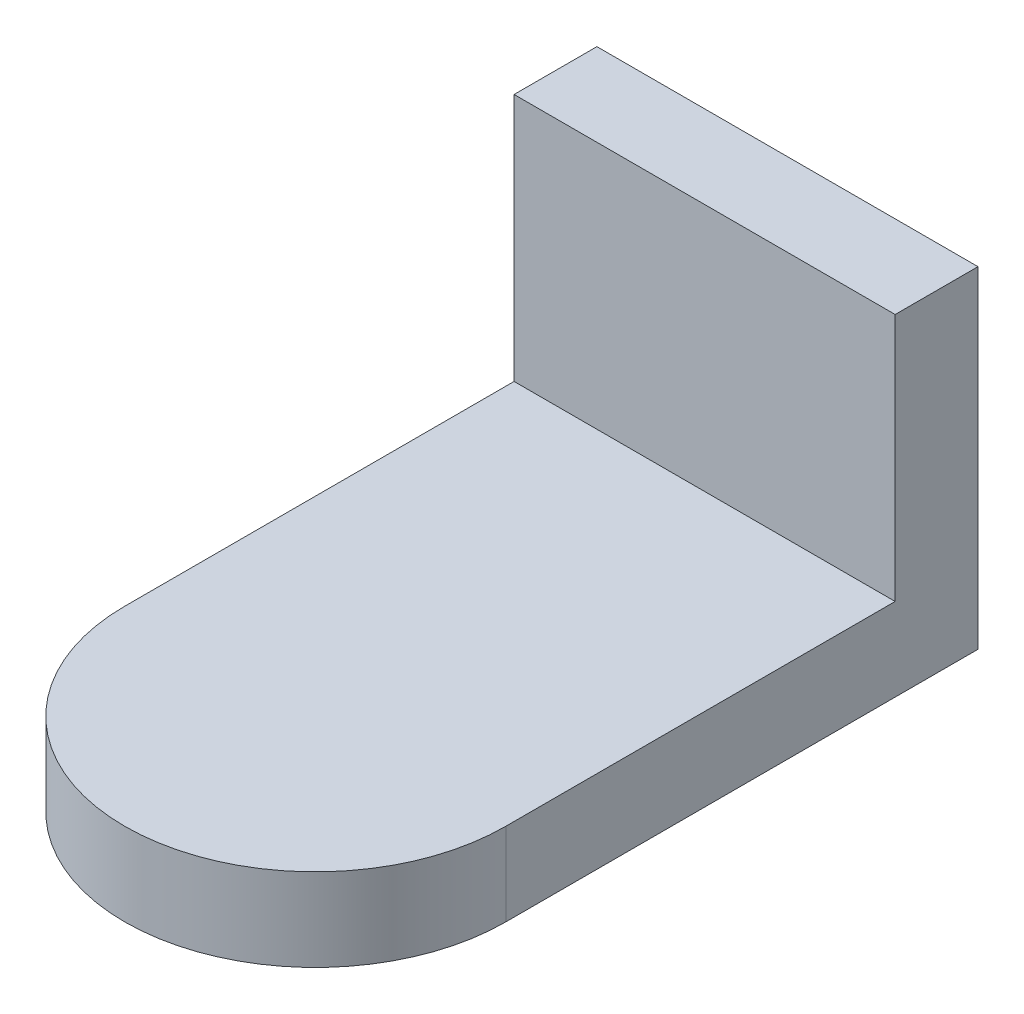
ISO-10303-21;
HEADER;
FILE_DESCRIPTION(('STEP AP214'),'2;1');
FILE_NAME('part.step','',(''),(''),'','','');
FILE_SCHEMA(('AUTOMOTIVE_DESIGN { 1 0 10303 214 1 1 1 1 }'));
ENDSEC;
DATA;
#1=APPLICATION_CONTEXT('core data for automotive mechanical design processes');
#2=APPLICATION_PROTOCOL_DEFINITION('international standard','automotive_design',2000,#1);
#3=PRODUCT_CONTEXT('',#1,'mechanical');
#4=PRODUCT('Part','Part','',(#3));
#5=PRODUCT_RELATED_PRODUCT_CATEGORY('part','',(#4));
#6=PRODUCT_DEFINITION_FORMATION('','',#4);
#7=PRODUCT_DEFINITION_CONTEXT('part definition',#1,'design');
#8=PRODUCT_DEFINITION('design','',#6,#7);
#9=PRODUCT_DEFINITION_SHAPE('','',#8);
#10=(LENGTH_UNIT() NAMED_UNIT(*) SI_UNIT(.MILLI.,.METRE.));
#11=(NAMED_UNIT(*) PLANE_ANGLE_UNIT() SI_UNIT($,.RADIAN.));
#12=(NAMED_UNIT(*) SI_UNIT($,.STERADIAN.) SOLID_ANGLE_UNIT());
#13=UNCERTAINTY_MEASURE_WITH_UNIT(LENGTH_MEASURE(1.E-05),#10,'distance_accuracy_value','');
#14=(GEOMETRIC_REPRESENTATION_CONTEXT(3) GLOBAL_UNCERTAINTY_ASSIGNED_CONTEXT((#13)) GLOBAL_UNIT_ASSIGNED_CONTEXT((#10,
#11,#12)) REPRESENTATION_CONTEXT('',''));
#15=CARTESIAN_POINT('',(0.,0.,0.));
#16=DIRECTION('',(0.,0.,1.));
#17=DIRECTION('',(1.,0.,0.));
#18=AXIS2_PLACEMENT_3D('',#15,#16,#17);
#19=CARTESIAN_POINT('',(0.,0.,-1.45));
#20=DIRECTION('',(0.,0.,1.));
#21=DIRECTION('',(-1.,0.,0.));
#22=AXIS2_PLACEMENT_3D('',#19,#20,#21);
#23=PLANE('',#22);
#24=DIRECTION('',(0.,1.,0.));
#25=VECTOR('',#24,1.);
#26=CARTESIAN_POINT('',(0.865,-0.2,-1.45));
#27=LINE('',#26,#25);
#28=CARTESIAN_POINT('',(0.865,-0.35,-1.45));
#29=VERTEX_POINT('',#28);
#30=CARTESIAN_POINT('',(0.865,-0.2,-1.45));
#31=VERTEX_POINT('',#30);
#32=EDGE_CURVE('E11',#29,#31,#27,.T.);
#33=ORIENTED_EDGE('',*,*,#32,.T.);
#34=DIRECTION('',(-1.,0.,0.));
#35=VECTOR('',#34,1.);
#36=CARTESIAN_POINT('',(0.635,-0.2,-1.45));
#37=LINE('',#36,#35);
#38=CARTESIAN_POINT('',(0.635,-0.2,-1.45));
#39=VERTEX_POINT('',#38);
#40=EDGE_CURVE('E24',#31,#39,#37,.T.);
#41=ORIENTED_EDGE('',*,*,#40,.T.);
#42=DIRECTION('',(0.,-1.,0.));
#43=VECTOR('',#42,1.);
#44=CARTESIAN_POINT('',(0.635,-0.2,-1.45));
#45=LINE('',#44,#43);
#46=CARTESIAN_POINT('',(0.635,-0.35,-1.45));
#47=VERTEX_POINT('',#46);
#48=EDGE_CURVE('E117',#39,#47,#45,.T.);
#49=ORIENTED_EDGE('',*,*,#48,.T.);
#50=DIRECTION('',(-1.,0.,0.));
#51=VECTOR('',#50,1.);
#52=CARTESIAN_POINT('',(0.635,-0.35,-1.45));
#53=LINE('',#52,#51);
#54=EDGE_CURVE('E85',#29,#47,#53,.T.);
#55=ORIENTED_EDGE('',*,*,#54,.F.);
#56=EDGE_LOOP('',(#33,#41,#49,#55));
#57=FACE_BOUND('',#56,.T.);
#58=ADVANCED_FACE('F17',(#57),#23,.T.);
#59=CARTESIAN_POINT('',(0.635,-0.2,-1.45));
#60=DIRECTION('',(0.,1.,0.));
#61=DIRECTION('',(-1.,0.,0.));
#62=AXIS2_PLACEMENT_3D('',#59,#60,#61);
#63=PLANE('',#62);
#64=DIRECTION('',(-1.,0.,0.));
#65=VECTOR('',#64,1.);
#66=CARTESIAN_POINT('',(0.635,-0.2,-1.5));
#67=LINE('',#66,#65);
#68=CARTESIAN_POINT('',(0.865,-0.2,-1.5));
#69=VERTEX_POINT('',#68);
#70=CARTESIAN_POINT('',(0.635,-0.2,-1.5));
#71=VERTEX_POINT('',#70);
#72=EDGE_CURVE('E114',#69,#71,#67,.T.);
#73=ORIENTED_EDGE('',*,*,#72,.T.);
#74=DIRECTION('',(0.,0.,-1.));
#75=VECTOR('',#74,1.);
#76=CARTESIAN_POINT('',(0.635,-0.2,-1.45));
#77=LINE('',#76,#75);
#78=EDGE_CURVE('E111',#39,#71,#77,.T.);
#79=ORIENTED_EDGE('',*,*,#78,.F.);
#80=ORIENTED_EDGE('',*,*,#40,.F.);
#81=DIRECTION('',(0.,0.,-1.));
#82=VECTOR('',#81,1.);
#83=CARTESIAN_POINT('',(0.865,-0.2,-1.45));
#84=LINE('',#83,#82);
#85=EDGE_CURVE('E108',#31,#69,#84,.T.);
#86=ORIENTED_EDGE('',*,*,#85,.T.);
#87=EDGE_LOOP('',(#73,#79,#80,#86));
#88=FACE_BOUND('',#87,.T.);
#89=ADVANCED_FACE('F121',(#88),#63,.T.);
#90=CARTESIAN_POINT('',(0.865,-0.2,-1.45));
#91=DIRECTION('',(1.,0.,0.));
#92=DIRECTION('',(0.,0.,1.));
#93=AXIS2_PLACEMENT_3D('',#90,#91,#92);
#94=PLANE('',#93);
#95=DIRECTION('',(0.,1.,0.));
#96=VECTOR('',#95,1.);
#97=CARTESIAN_POINT('',(0.865,-0.2,-1.5));
#98=LINE('',#97,#96);
#99=CARTESIAN_POINT('',(0.865,-0.4,-1.5));
#100=VERTEX_POINT('',#99);
#101=EDGE_CURVE('E105',#100,#69,#98,.T.);
#102=ORIENTED_EDGE('',*,*,#101,.T.);
#103=ORIENTED_EDGE('',*,*,#85,.F.);
#104=ORIENTED_EDGE('',*,*,#32,.F.);
#105=DIRECTION('',(0.,0.,-1.));
#106=VECTOR('',#105,1.);
#107=CARTESIAN_POINT('',(0.865,-0.35,-1.45));
#108=LINE('',#107,#106);
#109=CARTESIAN_POINT('',(0.865,-0.35,-1.215));
#110=VERTEX_POINT('',#109);
#111=EDGE_CURVE('E103',#110,#29,#108,.T.);
#112=ORIENTED_EDGE('',*,*,#111,.F.);
#113=DIRECTION('',(0.,-1.,0.));
#114=VECTOR('',#113,1.);
#115=CARTESIAN_POINT('',(0.865,-0.35,-1.215));
#116=LINE('',#115,#114);
#117=CARTESIAN_POINT('',(0.865,-0.4,-1.215));
#118=VERTEX_POINT('',#117);
#119=EDGE_CURVE('E89',#110,#118,#116,.T.);
#120=ORIENTED_EDGE('',*,*,#119,.T.);
#121=DIRECTION('',(0.,0.,-1.));
#122=VECTOR('',#121,1.);
#123=CARTESIAN_POINT('',(0.865,-0.4,-1.45));
#124=LINE('',#123,#122);
#125=EDGE_CURVE('E99',#118,#100,#124,.T.);
#126=ORIENTED_EDGE('',*,*,#125,.T.);
#127=EDGE_LOOP('',(#102,#103,#104,#112,#120,#126));
#128=FACE_BOUND('',#127,.T.);
#129=ADVANCED_FACE('F127',(#128),#94,.T.);
#130=CARTESIAN_POINT('',(0.635,-0.4,-1.45));
#131=DIRECTION('',(0.,-1.,0.));
#132=DIRECTION('',(1.,0.,0.));
#133=AXIS2_PLACEMENT_3D('',#130,#131,#132);
#134=PLANE('',#133);
#135=DIRECTION('',(1.,0.,0.));
#136=VECTOR('',#135,1.);
#137=CARTESIAN_POINT('',(0.635,-0.4,-1.5));
#138=LINE('',#137,#136);
#139=CARTESIAN_POINT('',(0.635,-0.4,-1.5));
#140=VERTEX_POINT('',#139);
#141=EDGE_CURVE('E96',#140,#100,#138,.T.);
#142=ORIENTED_EDGE('',*,*,#141,.T.);
#143=ORIENTED_EDGE('',*,*,#125,.F.);
#144=CARTESIAN_POINT('',(0.75,-0.4,-1.215));
#145=DIRECTION('',(0.,1.,0.));
#146=DIRECTION('',(1.,0.,0.));
#147=AXIS2_PLACEMENT_3D('',#144,#145,#146);
#148=CIRCLE('',#147,0.115);
#149=CARTESIAN_POINT('',(0.635,-0.4,-1.215));
#150=VERTEX_POINT('',#149);
#151=EDGE_CURVE('E94',#150,#118,#148,.T.);
#152=ORIENTED_EDGE('',*,*,#151,.F.);
#153=DIRECTION('',(0.,0.,-1.));
#154=VECTOR('',#153,1.);
#155=CARTESIAN_POINT('',(0.635,-0.4,-1.45));
#156=LINE('',#155,#154);
#157=EDGE_CURVE('E73',#150,#140,#156,.T.);
#158=ORIENTED_EDGE('',*,*,#157,.T.);
#159=EDGE_LOOP('',(#142,#143,#152,#158));
#160=FACE_BOUND('',#159,.T.);
#161=ADVANCED_FACE('F126',(#160),#134,.T.);
#162=CARTESIAN_POINT('',(0.635,-0.2,-1.45));
#163=DIRECTION('',(-1.,0.,0.));
#164=DIRECTION('',(0.,0.,-1.));
#165=AXIS2_PLACEMENT_3D('',#162,#163,#164);
#166=PLANE('',#165);
#167=DIRECTION('',(0.,-1.,0.));
#168=VECTOR('',#167,1.);
#169=CARTESIAN_POINT('',(0.635,-0.2,-1.5));
#170=LINE('',#169,#168);
#171=EDGE_CURVE('E77',#71,#140,#170,.T.);
#172=ORIENTED_EDGE('',*,*,#171,.T.);
#173=ORIENTED_EDGE('',*,*,#157,.F.);
#174=DIRECTION('',(0.,-1.,0.));
#175=VECTOR('',#174,1.);
#176=CARTESIAN_POINT('',(0.635,-0.35,-1.215));
#177=LINE('',#176,#175);
#178=CARTESIAN_POINT('',(0.635,-0.35,-1.215));
#179=VERTEX_POINT('',#178);
#180=EDGE_CURVE('E66',#179,#150,#177,.T.);
#181=ORIENTED_EDGE('',*,*,#180,.F.);
#182=DIRECTION('',(0.,0.,1.));
#183=VECTOR('',#182,1.);
#184=CARTESIAN_POINT('',(0.635,-0.35,-1.45));
#185=LINE('',#184,#183);
#186=EDGE_CURVE('E71',#47,#179,#185,.T.);
#187=ORIENTED_EDGE('',*,*,#186,.F.);
#188=ORIENTED_EDGE('',*,*,#48,.F.);
#189=ORIENTED_EDGE('',*,*,#78,.T.);
#190=EDGE_LOOP('',(#172,#173,#181,#187,#188,#189));
#191=FACE_BOUND('',#190,.T.);
#192=ADVANCED_FACE('F69',(#191),#166,.T.);
#193=CARTESIAN_POINT('',(0.,0.,-1.5));
#194=DIRECTION('',(0.,0.,1.));
#195=DIRECTION('',(-1.,0.,0.));
#196=AXIS2_PLACEMENT_3D('',#193,#194,#195);
#197=PLANE('',#196);
#198=ORIENTED_EDGE('',*,*,#72,.F.);
#199=ORIENTED_EDGE('',*,*,#101,.F.);
#200=ORIENTED_EDGE('',*,*,#141,.F.);
#201=ORIENTED_EDGE('',*,*,#171,.F.);
#202=EDGE_LOOP('',(#198,#199,#200,#201));
#203=FACE_BOUND('',#202,.T.);
#204=ADVANCED_FACE('F123',(#203),#197,.F.);
#205=CARTESIAN_POINT('',(0.75,-0.35,-1.215));
#206=DIRECTION('',(0.,-1.,0.));
#207=DIRECTION('',(1.,0.,0.));
#208=AXIS2_PLACEMENT_3D('',#205,#206,#207);
#209=CYLINDRICAL_SURFACE('',#208,0.115);
#210=ORIENTED_EDGE('',*,*,#151,.T.);
#211=ORIENTED_EDGE('',*,*,#119,.F.);
#212=CARTESIAN_POINT('',(0.75,-0.35,-1.215));
#213=DIRECTION('',(0.,1.,0.));
#214=DIRECTION('',(1.,0.,0.));
#215=AXIS2_PLACEMENT_3D('',#212,#213,#214);
#216=CIRCLE('',#215,0.115);
#217=EDGE_CURVE('E84',#179,#110,#216,.T.);
#218=ORIENTED_EDGE('',*,*,#217,.F.);
#219=ORIENTED_EDGE('',*,*,#180,.T.);
#220=EDGE_LOOP('',(#210,#211,#218,#219));
#221=FACE_BOUND('',#220,.T.);
#222=ADVANCED_FACE('F88',(#221),#209,.T.);
#223=CARTESIAN_POINT('',(0.75,-0.35,-1.215));
#224=DIRECTION('',(0.,-1.,0.));
#225=DIRECTION('',(1.,0.,0.));
#226=AXIS2_PLACEMENT_3D('',#223,#224,#225);
#227=PLANE('',#226);
#228=ORIENTED_EDGE('',*,*,#186,.T.);
#229=ORIENTED_EDGE('',*,*,#217,.T.);
#230=ORIENTED_EDGE('',*,*,#111,.T.);
#231=ORIENTED_EDGE('',*,*,#54,.T.);
#232=EDGE_LOOP('',(#228,#229,#230,#231));
#233=FACE_BOUND('',#232,.T.);
#234=ADVANCED_FACE('F82',(#233),#227,.F.);
#235=CLOSED_SHELL('',(#58,#89,#129,#161,#192,#204,#222,#234));
#236=MANIFOLD_SOLID_BREP('B1',#235);
#237=ADVANCED_BREP_SHAPE_REPRESENTATION('',(#18,#236),#14);
#238=SHAPE_DEFINITION_REPRESENTATION(#9,#237);
ENDSEC;
END-ISO-10303-21;
